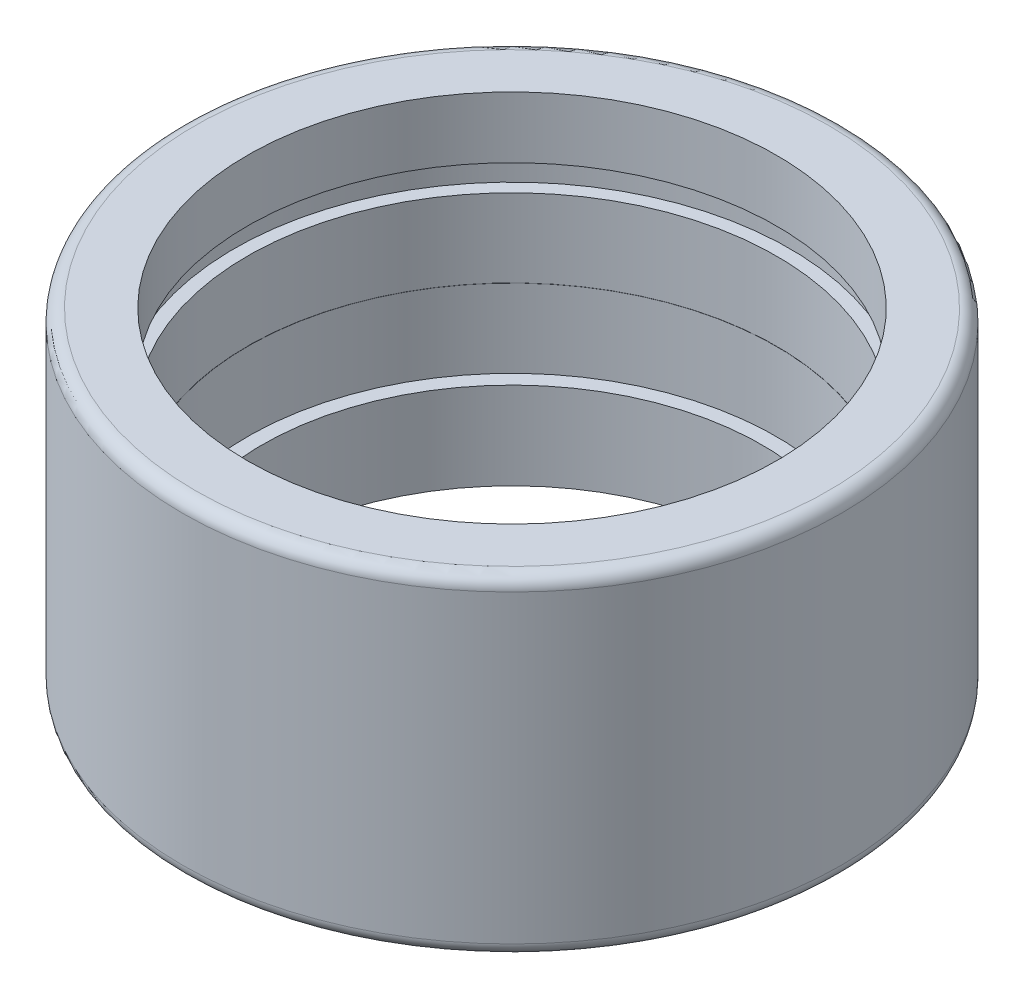
ISO-10303-21;
HEADER;
FILE_DESCRIPTION(('STEP AP214'),'2;1');
FILE_NAME('part.step','',(''),(''),'','','');
FILE_SCHEMA(('AUTOMOTIVE_DESIGN { 1 0 10303 214 1 1 1 1 }'));
ENDSEC;
DATA;
#1=APPLICATION_CONTEXT('core data for automotive mechanical design processes');
#2=APPLICATION_PROTOCOL_DEFINITION('international standard','automotive_design',2000,#1);
#3=PRODUCT_CONTEXT('',#1,'mechanical');
#4=PRODUCT('Part','Part','',(#3));
#5=PRODUCT_RELATED_PRODUCT_CATEGORY('part','',(#4));
#6=PRODUCT_DEFINITION_FORMATION('','',#4);
#7=PRODUCT_DEFINITION_CONTEXT('part definition',#1,'design');
#8=PRODUCT_DEFINITION('design','',#6,#7);
#9=PRODUCT_DEFINITION_SHAPE('','',#8);
#10=(LENGTH_UNIT() NAMED_UNIT(*) SI_UNIT(.MILLI.,.METRE.));
#11=(NAMED_UNIT(*) PLANE_ANGLE_UNIT() SI_UNIT($,.RADIAN.));
#12=(NAMED_UNIT(*) SI_UNIT($,.STERADIAN.) SOLID_ANGLE_UNIT());
#13=UNCERTAINTY_MEASURE_WITH_UNIT(LENGTH_MEASURE(1.E-05),#10,'distance_accuracy_value','');
#14=(GEOMETRIC_REPRESENTATION_CONTEXT(3) GLOBAL_UNCERTAINTY_ASSIGNED_CONTEXT((#13)) GLOBAL_UNIT_ASSIGNED_CONTEXT((#10,
#11,#12)) REPRESENTATION_CONTEXT('',''));
#15=CARTESIAN_POINT('',(0.,0.,0.));
#16=DIRECTION('',(0.,0.,1.));
#17=DIRECTION('',(1.,0.,0.));
#18=AXIS2_PLACEMENT_3D('',#15,#16,#17);
#19=CARTESIAN_POINT('',(0.,10.826,0.));
#20=DIRECTION('',(0.,-1.,0.));
#21=DIRECTION('',(0.,0.,-1.));
#22=AXIS2_PLACEMENT_3D('',#19,#20,#21);
#23=CYLINDRICAL_SURFACE('',#22,10.16);
#24=CARTESIAN_POINT('',(0.,0.,0.));
#25=DIRECTION('',(0.,1.,0.));
#26=DIRECTION('',(0.,0.,1.));
#27=AXIS2_PLACEMENT_3D('',#24,#25,#26);
#28=CIRCLE('',#27,10.16);
#29=CARTESIAN_POINT('',(0.,0.,10.16));
#30=VERTEX_POINT('',#29);
#31=EDGE_CURVE('E58',#30,#30,#28,.T.);
#32=ORIENTED_EDGE('',*,*,#31,.F.);
#33=EDGE_LOOP('',(#32));
#34=FACE_BOUND('',#33,.T.);
#35=CARTESIAN_POINT('',(0.,2.9972,0.));
#36=DIRECTION('',(0.,1.,0.));
#37=DIRECTION('',(0.,0.,1.));
#38=AXIS2_PLACEMENT_3D('',#35,#36,#37);
#39=CIRCLE('',#38,10.16);
#40=CARTESIAN_POINT('',(0.,2.9972,10.16));
#41=VERTEX_POINT('',#40);
#42=EDGE_CURVE('E59',#41,#41,#39,.T.);
#43=ORIENTED_EDGE('',*,*,#42,.T.);
#44=EDGE_LOOP('',(#43));
#45=FACE_BOUND('',#44,.T.);
#46=ADVANCED_FACE('F34',(#34,#45),#23,.F.);
#47=CARTESIAN_POINT('',(0.,-3.,0.));
#48=DIRECTION('',(0.,1.,0.));
#49=DIRECTION('',(0.,0.,1.));
#50=AXIS2_PLACEMENT_3D('',#47,#48,#49);
#51=CYLINDRICAL_SURFACE('',#50,10.15238);
#52=CARTESIAN_POINT('',(0.,-3.,0.));
#53=DIRECTION('',(0.,1.,0.));
#54=DIRECTION('',(0.,0.,1.));
#55=AXIS2_PLACEMENT_3D('',#52,#53,#54);
#56=CIRCLE('',#55,10.15238);
#57=CARTESIAN_POINT('',(0.,-3.,10.15238));
#58=VERTEX_POINT('',#57);
#59=EDGE_CURVE('E66',#58,#58,#56,.T.);
#60=ORIENTED_EDGE('',*,*,#59,.F.);
#61=EDGE_LOOP('',(#60));
#62=FACE_BOUND('',#61,.T.);
#63=CARTESIAN_POINT('',(0.,0.,0.));
#64=DIRECTION('',(0.,1.,0.));
#65=DIRECTION('',(0.,0.,1.));
#66=AXIS2_PLACEMENT_3D('',#63,#64,#65);
#67=CIRCLE('',#66,10.15238);
#68=CARTESIAN_POINT('',(0.,0.,10.15238));
#69=VERTEX_POINT('',#68);
#70=EDGE_CURVE('E67',#69,#69,#67,.F.);
#71=ORIENTED_EDGE('',*,*,#70,.F.);
#72=EDGE_LOOP('',(#71));
#73=FACE_BOUND('',#72,.T.);
#74=ADVANCED_FACE('F103',(#62,#73),#51,.F.);
#75=CARTESIAN_POINT('',(0.,-6.35,0.));
#76=DIRECTION('',(0.,1.,0.));
#77=DIRECTION('',(0.,0.,1.));
#78=AXIS2_PLACEMENT_3D('',#75,#76,#77);
#79=CYLINDRICAL_SURFACE('',#78,9.6);
#80=CARTESIAN_POINT('',(0.,-6.35,0.));
#81=DIRECTION('',(0.,1.,0.));
#82=DIRECTION('',(0.,0.,1.));
#83=AXIS2_PLACEMENT_3D('',#80,#81,#82);
#84=CIRCLE('',#83,9.6);
#85=CARTESIAN_POINT('',(0.,-6.35,9.6));
#86=VERTEX_POINT('',#85);
#87=EDGE_CURVE('E54',#86,#86,#84,.T.);
#88=ORIENTED_EDGE('',*,*,#87,.F.);
#89=EDGE_LOOP('',(#88));
#90=FACE_BOUND('',#89,.T.);
#91=CARTESIAN_POINT('',(0.,-3.,0.));
#92=DIRECTION('',(0.,1.,0.));
#93=DIRECTION('',(0.,0.,1.));
#94=AXIS2_PLACEMENT_3D('',#91,#92,#93);
#95=CIRCLE('',#94,9.6);
#96=CARTESIAN_POINT('',(0.,-3.,9.6));
#97=VERTEX_POINT('',#96);
#98=EDGE_CURVE('E70',#97,#97,#95,.F.);
#99=ORIENTED_EDGE('',*,*,#98,.F.);
#100=EDGE_LOOP('',(#99));
#101=FACE_BOUND('',#100,.T.);
#102=ADVANCED_FACE('F109',(#90,#101),#79,.F.);
#103=CARTESIAN_POINT('',(0.,6.35,0.));
#104=DIRECTION('',(0.,-1.,0.));
#105=DIRECTION('',(0.,0.,-1.));
#106=AXIS2_PLACEMENT_3D('',#103,#104,#105);
#107=CYLINDRICAL_SURFACE('',#106,12.65);
#108=CARTESIAN_POINT('',(0.,-5.85,0.));
#109=DIRECTION('',(0.,1.,0.));
#110=DIRECTION('',(0.,0.,1.));
#111=AXIS2_PLACEMENT_3D('',#108,#109,#110);
#112=CIRCLE('',#111,12.65);
#113=CARTESIAN_POINT('',(0.,-5.85,12.65));
#114=VERTEX_POINT('',#113);
#115=EDGE_CURVE('E45',#114,#114,#112,.T.);
#116=ORIENTED_EDGE('',*,*,#115,.T.);
#117=EDGE_LOOP('',(#116));
#118=FACE_BOUND('',#117,.T.);
#119=CARTESIAN_POINT('',(0.,5.85,0.));
#120=DIRECTION('',(0.,1.,0.));
#121=DIRECTION('',(0.,0.,1.));
#122=AXIS2_PLACEMENT_3D('',#119,#120,#121);
#123=CIRCLE('',#122,12.65);
#124=CARTESIAN_POINT('',(0.,5.85,12.65));
#125=VERTEX_POINT('',#124);
#126=EDGE_CURVE('E49',#125,#125,#123,.F.);
#127=ORIENTED_EDGE('',*,*,#126,.T.);
#128=EDGE_LOOP('',(#127));
#129=FACE_BOUND('',#128,.T.);
#130=ADVANCED_FACE('F131',(#118,#129),#107,.T.);
#131=CARTESIAN_POINT('',(0.,6.35,0.));
#132=DIRECTION('',(0.,1.,0.));
#133=DIRECTION('',(0.,0.,1.));
#134=AXIS2_PLACEMENT_3D('',#131,#132,#133);
#135=PLANE('',#134);
#136=CARTESIAN_POINT('',(0.,6.35,0.));
#137=DIRECTION('',(0.,1.,0.));
#138=DIRECTION('',(0.,0.,1.));
#139=AXIS2_PLACEMENT_3D('',#136,#137,#138);
#140=CIRCLE('',#139,12.15);
#141=CARTESIAN_POINT('',(0.,6.35,12.15));
#142=VERTEX_POINT('',#141);
#143=EDGE_CURVE('E10',#142,#142,#140,.T.);
#144=ORIENTED_EDGE('',*,*,#143,.T.);
#145=EDGE_LOOP('',(#144));
#146=FACE_BOUND('',#145,.T.);
#147=CARTESIAN_POINT('',(0.,6.35,0.));
#148=DIRECTION('',(0.,1.,0.));
#149=DIRECTION('',(0.,0.,1.));
#150=AXIS2_PLACEMENT_3D('',#147,#148,#149);
#151=CIRCLE('',#150,10.16);
#152=CARTESIAN_POINT('',(0.,6.35,10.16));
#153=VERTEX_POINT('',#152);
#154=EDGE_CURVE('E63',#153,#153,#151,.F.);
#155=ORIENTED_EDGE('',*,*,#154,.T.);
#156=EDGE_LOOP('',(#155));
#157=FACE_BOUND('',#156,.T.);
#158=ADVANCED_FACE('F128',(#146,#157),#135,.T.);
#159=CARTESIAN_POINT('',(0.,-6.35,0.));
#160=DIRECTION('',(0.,1.,0.));
#161=DIRECTION('',(0.,0.,1.));
#162=AXIS2_PLACEMENT_3D('',#159,#160,#161);
#163=PLANE('',#162);
#164=CARTESIAN_POINT('',(0.,-6.35,0.));
#165=DIRECTION('',(0.,1.,0.));
#166=DIRECTION('',(0.,0.,1.));
#167=AXIS2_PLACEMENT_3D('',#164,#165,#166);
#168=CIRCLE('',#167,12.15);
#169=CARTESIAN_POINT('',(0.,-6.35,12.15));
#170=VERTEX_POINT('',#169);
#171=EDGE_CURVE('E41',#170,#170,#168,.F.);
#172=ORIENTED_EDGE('',*,*,#171,.T.);
#173=EDGE_LOOP('',(#172));
#174=FACE_BOUND('',#173,.T.);
#175=ORIENTED_EDGE('',*,*,#87,.T.);
#176=EDGE_LOOP('',(#175));
#177=FACE_BOUND('',#176,.T.);
#178=ADVANCED_FACE('F130',(#174,#177),#163,.F.);
#179=CARTESIAN_POINT('',(0.,-3.,0.));
#180=DIRECTION('',(0.,1.,0.));
#181=DIRECTION('',(0.,0.,1.));
#182=AXIS2_PLACEMENT_3D('',#179,#180,#181);
#183=PLANE('',#182);
#184=ORIENTED_EDGE('',*,*,#59,.T.);
#185=EDGE_LOOP('',(#184));
#186=FACE_BOUND('',#185,.T.);
#187=ORIENTED_EDGE('',*,*,#98,.T.);
#188=EDGE_LOOP('',(#187));
#189=FACE_BOUND('',#188,.T.);
#190=ADVANCED_FACE('F122',(#186,#189),#183,.T.);
#191=CARTESIAN_POINT('',(0.,0.,0.));
#192=DIRECTION('',(0.,1.,0.));
#193=DIRECTION('',(0.,0.,1.));
#194=AXIS2_PLACEMENT_3D('',#191,#192,#193);
#195=PLANE('',#194);
#196=ORIENTED_EDGE('',*,*,#31,.T.);
#197=EDGE_LOOP('',(#196));
#198=FACE_BOUND('',#197,.T.);
#199=ORIENTED_EDGE('',*,*,#70,.T.);
#200=EDGE_LOOP('',(#199));
#201=FACE_BOUND('',#200,.T.);
#202=ADVANCED_FACE('F117',(#198,#201),#195,.T.);
#203=CARTESIAN_POINT('',(0.,3.9972,0.));
#204=DIRECTION('',(0.,1.,0.));
#205=DIRECTION('',(0.,0.,1.));
#206=AXIS2_PLACEMENT_3D('',#203,#204,#205);
#207=CIRCLE('',#206,10.16);
#208=CARTESIAN_POINT('',(0.,3.9972,10.16));
#209=VERTEX_POINT('',#208);
#210=EDGE_CURVE('E55',#209,#209,#207,.T.);
#211=ORIENTED_EDGE('',*,*,#210,.F.);
#212=EDGE_LOOP('',(#211));
#213=FACE_BOUND('',#212,.T.);
#214=ORIENTED_EDGE('',*,*,#154,.F.);
#215=EDGE_LOOP('',(#214));
#216=FACE_BOUND('',#215,.T.);
#217=ADVANCED_FACE('F100',(#213,#216),#23,.F.);
#218=CARTESIAN_POINT('',(0.,3.9972,0.));
#219=DIRECTION('',(0.,-1.,0.));
#220=DIRECTION('',(0.,0.,-1.));
#221=AXIS2_PLACEMENT_3D('',#218,#219,#220);
#222=CYLINDRICAL_SURFACE('',#221,10.66038);
#223=CARTESIAN_POINT('',(0.,3.9972,0.));
#224=DIRECTION('',(0.,1.,0.));
#225=DIRECTION('',(0.,0.,1.));
#226=AXIS2_PLACEMENT_3D('',#223,#224,#225);
#227=CIRCLE('',#226,10.66038);
#228=CARTESIAN_POINT('',(0.,3.9972,10.66038));
#229=VERTEX_POINT('',#228);
#230=EDGE_CURVE('E62',#229,#229,#227,.T.);
#231=ORIENTED_EDGE('',*,*,#230,.T.);
#232=EDGE_LOOP('',(#231));
#233=FACE_BOUND('',#232,.T.);
#234=CARTESIAN_POINT('',(0.,2.9972,0.));
#235=DIRECTION('',(0.,1.,0.));
#236=DIRECTION('',(0.,0.,1.));
#237=AXIS2_PLACEMENT_3D('',#234,#235,#236);
#238=CIRCLE('',#237,10.66038);
#239=CARTESIAN_POINT('',(0.,2.9972,10.66038));
#240=VERTEX_POINT('',#239);
#241=EDGE_CURVE('E79',#240,#240,#238,.T.);
#242=ORIENTED_EDGE('',*,*,#241,.F.);
#243=EDGE_LOOP('',(#242));
#244=FACE_BOUND('',#243,.T.);
#245=ADVANCED_FACE('F85',(#233,#244),#222,.F.);
#246=CARTESIAN_POINT('',(0.,3.9972,0.));
#247=DIRECTION('',(0.,1.,0.));
#248=DIRECTION('',(0.,0.,1.));
#249=AXIS2_PLACEMENT_3D('',#246,#247,#248);
#250=PLANE('',#249);
#251=ORIENTED_EDGE('',*,*,#210,.T.);
#252=EDGE_LOOP('',(#251));
#253=FACE_BOUND('',#252,.T.);
#254=ORIENTED_EDGE('',*,*,#230,.F.);
#255=EDGE_LOOP('',(#254));
#256=FACE_BOUND('',#255,.T.);
#257=ADVANCED_FACE('F88',(#253,#256),#250,.F.);
#258=CARTESIAN_POINT('',(0.,2.9972,0.));
#259=DIRECTION('',(0.,1.,0.));
#260=DIRECTION('',(0.,0.,1.));
#261=AXIS2_PLACEMENT_3D('',#258,#259,#260);
#262=PLANE('',#261);
#263=ORIENTED_EDGE('',*,*,#42,.F.);
#264=EDGE_LOOP('',(#263));
#265=FACE_BOUND('',#264,.T.);
#266=ORIENTED_EDGE('',*,*,#241,.T.);
#267=EDGE_LOOP('',(#266));
#268=FACE_BOUND('',#267,.T.);
#269=ADVANCED_FACE('F90',(#265,#268),#262,.T.);
#270=CARTESIAN_POINT('',(0.,-5.85,0.));
#271=DIRECTION('',(0.,1.,0.));
#272=DIRECTION('',(0.,0.,1.));
#273=AXIS2_PLACEMENT_3D('',#270,#271,#272);
#274=TOROIDAL_SURFACE('',#273,12.15,0.5);
#275=ORIENTED_EDGE('',*,*,#171,.F.);
#276=EDGE_LOOP('',(#275));
#277=FACE_BOUND('',#276,.T.);
#278=ORIENTED_EDGE('',*,*,#115,.F.);
#279=EDGE_LOOP('',(#278));
#280=FACE_BOUND('',#279,.T.);
#281=ADVANCED_FACE('F97',(#277,#280),#274,.T.);
#282=CARTESIAN_POINT('',(0.,5.85,0.));
#283=DIRECTION('',(0.,1.,0.));
#284=DIRECTION('',(0.,0.,1.));
#285=AXIS2_PLACEMENT_3D('',#282,#283,#284);
#286=TOROIDAL_SURFACE('',#285,12.15,0.5);
#287=ORIENTED_EDGE('',*,*,#126,.F.);
#288=EDGE_LOOP('',(#287));
#289=FACE_BOUND('',#288,.T.);
#290=ORIENTED_EDGE('',*,*,#143,.F.);
#291=EDGE_LOOP('',(#290));
#292=FACE_BOUND('',#291,.T.);
#293=ADVANCED_FACE('F36',(#289,#292),#286,.T.);
#294=CLOSED_SHELL('',(#46,#74,#102,#130,#158,#178,#190,#202,#217,#245,#257,#269,#281,#293));
#295=MANIFOLD_SOLID_BREP('B2',#294);
#296=ADVANCED_BREP_SHAPE_REPRESENTATION('',(#18,#295),#14);
#297=SHAPE_DEFINITION_REPRESENTATION(#9,#296);
ENDSEC;
END-ISO-10303-21;
